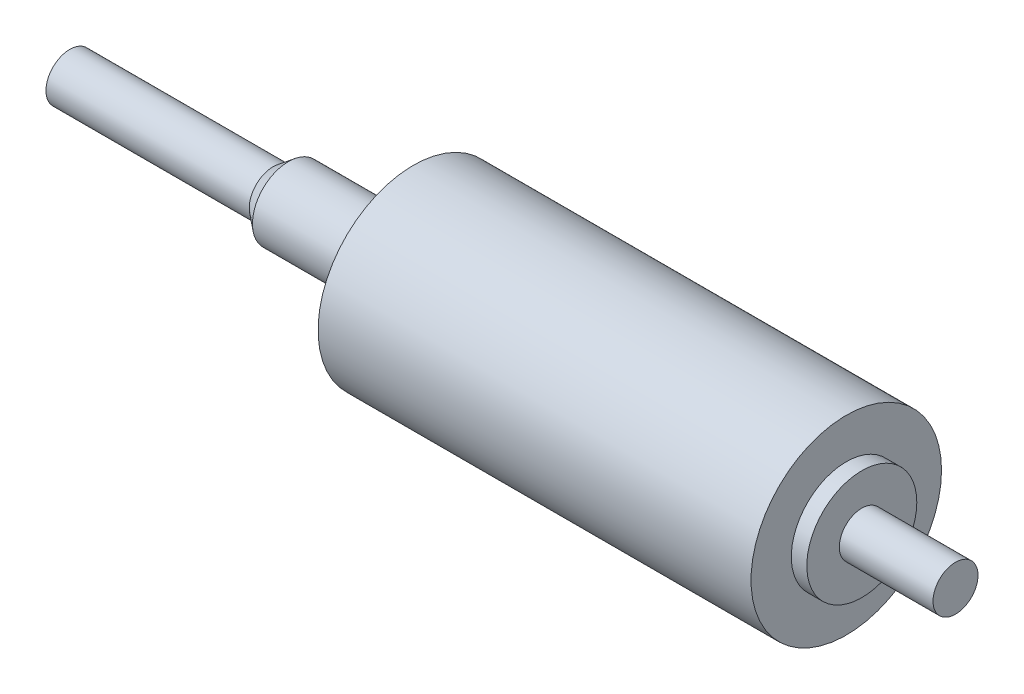
ISO-10303-21;
HEADER;
FILE_DESCRIPTION(('STEP AP214'),'2;1');
FILE_NAME('part.step','',(''),(''),'','','');
FILE_SCHEMA(('AUTOMOTIVE_DESIGN { 1 0 10303 214 1 1 1 1 }'));
ENDSEC;
DATA;
#1=APPLICATION_CONTEXT('core data for automotive mechanical design processes');
#2=APPLICATION_PROTOCOL_DEFINITION('international standard','automotive_design',2000,#1);
#3=PRODUCT_CONTEXT('',#1,'mechanical');
#4=PRODUCT('Part','Part','',(#3));
#5=PRODUCT_RELATED_PRODUCT_CATEGORY('part','',(#4));
#6=PRODUCT_DEFINITION_FORMATION('','',#4);
#7=PRODUCT_DEFINITION_CONTEXT('part definition',#1,'design');
#8=PRODUCT_DEFINITION('design','',#6,#7);
#9=PRODUCT_DEFINITION_SHAPE('','',#8);
#10=(LENGTH_UNIT() NAMED_UNIT(*) SI_UNIT(.MILLI.,.METRE.));
#11=(NAMED_UNIT(*) PLANE_ANGLE_UNIT() SI_UNIT($,.RADIAN.));
#12=(NAMED_UNIT(*) SI_UNIT($,.STERADIAN.) SOLID_ANGLE_UNIT());
#13=UNCERTAINTY_MEASURE_WITH_UNIT(LENGTH_MEASURE(1.E-05),#10,'distance_accuracy_value','');
#14=(GEOMETRIC_REPRESENTATION_CONTEXT(3) GLOBAL_UNCERTAINTY_ASSIGNED_CONTEXT((#13)) GLOBAL_UNIT_ASSIGNED_CONTEXT((#10,
#11,#12)) REPRESENTATION_CONTEXT('',''));
#15=CARTESIAN_POINT('',(0.,0.,0.));
#16=DIRECTION('',(0.,0.,1.));
#17=DIRECTION('',(1.,0.,0.));
#18=AXIS2_PLACEMENT_3D('',#15,#16,#17);
#19=CARTESIAN_POINT('',(-22.4917,1.5621,0.));
#20=DIRECTION('',(-1.,0.,0.));
#21=DIRECTION('',(0.,0.,1.));
#22=AXIS2_PLACEMENT_3D('',#19,#20,#21);
#23=PLANE('',#22);
#24=CARTESIAN_POINT('',(-22.4917,0.,0.));
#25=DIRECTION('',(1.,0.,0.));
#26=DIRECTION('',(0.,0.,-1.));
#27=AXIS2_PLACEMENT_3D('',#24,#25,#26);
#28=CIRCLE('',#27,1.5621);
#29=CARTESIAN_POINT('',(-22.4917,0.,-1.5621));
#30=VERTEX_POINT('',#29);
#31=EDGE_CURVE('E10',#30,#30,#28,.T.);
#32=ORIENTED_EDGE('',*,*,#31,.F.);
#33=EDGE_LOOP('',(#32));
#34=FACE_BOUND('',#33,.T.);
#35=ADVANCED_FACE('F37',(#34),#23,.T.);
#36=CARTESIAN_POINT('',(35.4965,0.,0.));
#37=DIRECTION('',(1.,0.,0.));
#38=DIRECTION('',(0.,0.,-1.));
#39=AXIS2_PLACEMENT_3D('',#36,#37,#38);
#40=CYLINDRICAL_SURFACE('',#39,1.5621);
#41=ORIENTED_EDGE('',*,*,#31,.T.);
#42=EDGE_LOOP('',(#41));
#43=FACE_BOUND('',#42,.T.);
#44=CARTESIAN_POINT('',(-9.1821,0.,0.));
#45=DIRECTION('',(1.,0.,0.));
#46=DIRECTION('',(0.,0.,-1.));
#47=AXIS2_PLACEMENT_3D('',#44,#45,#46);
#48=CIRCLE('',#47,1.5621);
#49=CARTESIAN_POINT('',(-9.1821,0.,-1.5621));
#50=VERTEX_POINT('',#49);
#51=EDGE_CURVE('E44',#50,#50,#48,.T.);
#52=ORIENTED_EDGE('',*,*,#51,.F.);
#53=EDGE_LOOP('',(#52));
#54=FACE_BOUND('',#53,.T.);
#55=ADVANCED_FACE('F101',(#43,#54),#40,.T.);
#56=CARTESIAN_POINT('',(-8.1788,0.,0.));
#57=DIRECTION('',(1.,0.,0.));
#58=DIRECTION('',(0.,0.,-1.));
#59=AXIS2_PLACEMENT_3D('',#56,#57,#58);
#60=CONICAL_SURFACE('',#59,2.35585,0.66931463889378);
#61=ORIENTED_EDGE('',*,*,#51,.T.);
#62=EDGE_LOOP('',(#61));
#63=FACE_BOUND('',#62,.T.);
#64=CARTESIAN_POINT('',(-8.1788,0.,0.));
#65=DIRECTION('',(1.,0.,0.));
#66=DIRECTION('',(0.,0.,-1.));
#67=AXIS2_PLACEMENT_3D('',#64,#65,#66);
#68=CIRCLE('',#67,2.35585);
#69=CARTESIAN_POINT('',(-8.1788,0.,-2.35585));
#70=VERTEX_POINT('',#69);
#71=EDGE_CURVE('E49',#70,#70,#68,.T.);
#72=ORIENTED_EDGE('',*,*,#71,.F.);
#73=EDGE_LOOP('',(#72));
#74=FACE_BOUND('',#73,.T.);
#75=ADVANCED_FACE('F106',(#63,#74),#60,.T.);
#76=CARTESIAN_POINT('',(35.4965,0.,0.));
#77=DIRECTION('',(1.,0.,0.));
#78=DIRECTION('',(0.,0.,-1.));
#79=AXIS2_PLACEMENT_3D('',#76,#77,#78);
#80=CYLINDRICAL_SURFACE('',#79,2.35585);
#81=ORIENTED_EDGE('',*,*,#71,.T.);
#82=EDGE_LOOP('',(#81));
#83=FACE_BOUND('',#82,.T.);
#84=CARTESIAN_POINT('',(0.,0.,0.));
#85=DIRECTION('',(1.,0.,0.));
#86=DIRECTION('',(0.,0.,-1.));
#87=AXIS2_PLACEMENT_3D('',#84,#85,#86);
#88=CIRCLE('',#87,2.35585);
#89=CARTESIAN_POINT('',(0.,0.,-2.35585));
#90=VERTEX_POINT('',#89);
#91=EDGE_CURVE('E54',#90,#90,#88,.T.);
#92=ORIENTED_EDGE('',*,*,#91,.F.);
#93=EDGE_LOOP('',(#92));
#94=FACE_BOUND('',#93,.T.);
#95=ADVANCED_FACE('F110',(#83,#94),#80,.T.);
#96=CARTESIAN_POINT('',(0.,6.2357,0.));
#97=DIRECTION('',(-1.,0.,0.));
#98=DIRECTION('',(0.,0.,1.));
#99=AXIS2_PLACEMENT_3D('',#96,#97,#98);
#100=PLANE('',#99);
#101=ORIENTED_EDGE('',*,*,#91,.T.);
#102=EDGE_LOOP('',(#101));
#103=FACE_BOUND('',#102,.T.);
#104=CARTESIAN_POINT('',(0.,0.,0.));
#105=DIRECTION('',(1.,0.,0.));
#106=DIRECTION('',(0.,0.,-1.));
#107=AXIS2_PLACEMENT_3D('',#104,#105,#106);
#108=CIRCLE('',#107,6.2357);
#109=CARTESIAN_POINT('',(0.,0.,-6.2357));
#110=VERTEX_POINT('',#109);
#111=EDGE_CURVE('E60',#110,#110,#108,.T.);
#112=ORIENTED_EDGE('',*,*,#111,.F.);
#113=EDGE_LOOP('',(#112));
#114=FACE_BOUND('',#113,.T.);
#115=ADVANCED_FACE('F116',(#103,#114),#100,.T.);
#116=CARTESIAN_POINT('',(35.4965,0.,0.));
#117=DIRECTION('',(1.,0.,0.));
#118=DIRECTION('',(0.,0.,-1.));
#119=AXIS2_PLACEMENT_3D('',#116,#117,#118);
#120=CYLINDRICAL_SURFACE('',#119,6.2357);
#121=ORIENTED_EDGE('',*,*,#111,.T.);
#122=EDGE_LOOP('',(#121));
#123=FACE_BOUND('',#122,.T.);
#124=CARTESIAN_POINT('',(28.3464,0.,0.));
#125=DIRECTION('',(1.,0.,0.));
#126=DIRECTION('',(0.,0.,-1.));
#127=AXIS2_PLACEMENT_3D('',#124,#125,#126);
#128=CIRCLE('',#127,6.2357);
#129=CARTESIAN_POINT('',(28.3464,0.,-6.2357));
#130=VERTEX_POINT('',#129);
#131=EDGE_CURVE('E64',#130,#130,#128,.T.);
#132=ORIENTED_EDGE('',*,*,#131,.F.);
#133=EDGE_LOOP('',(#132));
#134=FACE_BOUND('',#133,.T.);
#135=ADVANCED_FACE('F120',(#123,#134),#120,.T.);
#136=CARTESIAN_POINT('',(28.3464,6.2357,0.));
#137=DIRECTION('',(1.,0.,0.));
#138=DIRECTION('',(0.,0.,-1.));
#139=AXIS2_PLACEMENT_3D('',#136,#137,#138);
#140=PLANE('',#139);
#141=ORIENTED_EDGE('',*,*,#131,.T.);
#142=EDGE_LOOP('',(#141));
#143=FACE_BOUND('',#142,.T.);
#144=CARTESIAN_POINT('',(28.3464,0.,0.));
#145=DIRECTION('',(1.,0.,0.));
#146=DIRECTION('',(0.,0.,-1.));
#147=AXIS2_PLACEMENT_3D('',#144,#145,#146);
#148=CIRCLE('',#147,3.60045);
#149=CARTESIAN_POINT('',(28.3464,0.,-3.60045));
#150=VERTEX_POINT('',#149);
#151=EDGE_CURVE('E68',#150,#150,#148,.T.);
#152=ORIENTED_EDGE('',*,*,#151,.F.);
#153=EDGE_LOOP('',(#152));
#154=FACE_BOUND('',#153,.T.);
#155=ADVANCED_FACE('F124',(#143,#154),#140,.T.);
#156=CARTESIAN_POINT('',(35.4965,0.,0.));
#157=DIRECTION('',(1.,0.,0.));
#158=DIRECTION('',(0.,0.,-1.));
#159=AXIS2_PLACEMENT_3D('',#156,#157,#158);
#160=CYLINDRICAL_SURFACE('',#159,3.60045);
#161=ORIENTED_EDGE('',*,*,#151,.T.);
#162=EDGE_LOOP('',(#161));
#163=FACE_BOUND('',#162,.T.);
#164=CARTESIAN_POINT('',(29.3624,0.,0.));
#165=DIRECTION('',(1.,0.,0.));
#166=DIRECTION('',(0.,0.,-1.));
#167=AXIS2_PLACEMENT_3D('',#164,#165,#166);
#168=CIRCLE('',#167,3.60045);
#169=CARTESIAN_POINT('',(29.3624,0.,-3.60045));
#170=VERTEX_POINT('',#169);
#171=EDGE_CURVE('E72',#170,#170,#168,.T.);
#172=ORIENTED_EDGE('',*,*,#171,.F.);
#173=EDGE_LOOP('',(#172));
#174=FACE_BOUND('',#173,.T.);
#175=ADVANCED_FACE('F97',(#163,#174),#160,.T.);
#176=CARTESIAN_POINT('',(29.3624,3.60045,0.));
#177=DIRECTION('',(1.,0.,0.));
#178=DIRECTION('',(0.,0.,-1.));
#179=AXIS2_PLACEMENT_3D('',#176,#177,#178);
#180=PLANE('',#179);
#181=ORIENTED_EDGE('',*,*,#171,.T.);
#182=EDGE_LOOP('',(#181));
#183=FACE_BOUND('',#182,.T.);
#184=CARTESIAN_POINT('',(29.3624,0.,0.));
#185=DIRECTION('',(1.,0.,0.));
#186=DIRECTION('',(0.,0.,-1.));
#187=AXIS2_PLACEMENT_3D('',#184,#185,#186);
#188=CIRCLE('',#187,1.4732);
#189=CARTESIAN_POINT('',(29.3624,0.,-1.4732));
#190=VERTEX_POINT('',#189);
#191=EDGE_CURVE('E76',#190,#190,#188,.T.);
#192=ORIENTED_EDGE('',*,*,#191,.F.);
#193=EDGE_LOOP('',(#192));
#194=FACE_BOUND('',#193,.T.);
#195=ADVANCED_FACE('F89',(#183,#194),#180,.T.);
#196=CARTESIAN_POINT('',(35.4965,0.,0.));
#197=DIRECTION('',(1.,0.,0.));
#198=DIRECTION('',(0.,0.,-1.));
#199=AXIS2_PLACEMENT_3D('',#196,#197,#198);
#200=CYLINDRICAL_SURFACE('',#199,1.4732);
#201=ORIENTED_EDGE('',*,*,#191,.T.);
#202=EDGE_LOOP('',(#201));
#203=FACE_BOUND('',#202,.T.);
#204=CARTESIAN_POINT('',(35.4965,0.,0.));
#205=DIRECTION('',(1.,0.,0.));
#206=DIRECTION('',(0.,0.,-1.));
#207=AXIS2_PLACEMENT_3D('',#204,#205,#206);
#208=CIRCLE('',#207,1.4732);
#209=CARTESIAN_POINT('',(35.4965,0.,-1.4732));
#210=VERTEX_POINT('',#209);
#211=EDGE_CURVE('E80',#210,#210,#208,.T.);
#212=ORIENTED_EDGE('',*,*,#211,.F.);
#213=EDGE_LOOP('',(#212));
#214=FACE_BOUND('',#213,.T.);
#215=ADVANCED_FACE('F87',(#203,#214),#200,.T.);
#216=CARTESIAN_POINT('',(35.4965,1.4732,0.));
#217=DIRECTION('',(1.,0.,0.));
#218=DIRECTION('',(0.,0.,-1.));
#219=AXIS2_PLACEMENT_3D('',#216,#217,#218);
#220=PLANE('',#219);
#221=ORIENTED_EDGE('',*,*,#211,.T.);
#222=EDGE_LOOP('',(#221));
#223=FACE_BOUND('',#222,.T.);
#224=ADVANCED_FACE('F85',(#223),#220,.T.);
#225=CLOSED_SHELL('',(#35,#55,#75,#95,#115,#135,#155,#175,#195,#215,#224));
#226=MANIFOLD_SOLID_BREP('B2',#225);
#227=ADVANCED_BREP_SHAPE_REPRESENTATION('',(#18,#226),#14);
#228=SHAPE_DEFINITION_REPRESENTATION(#9,#227);
ENDSEC;
END-ISO-10303-21;
